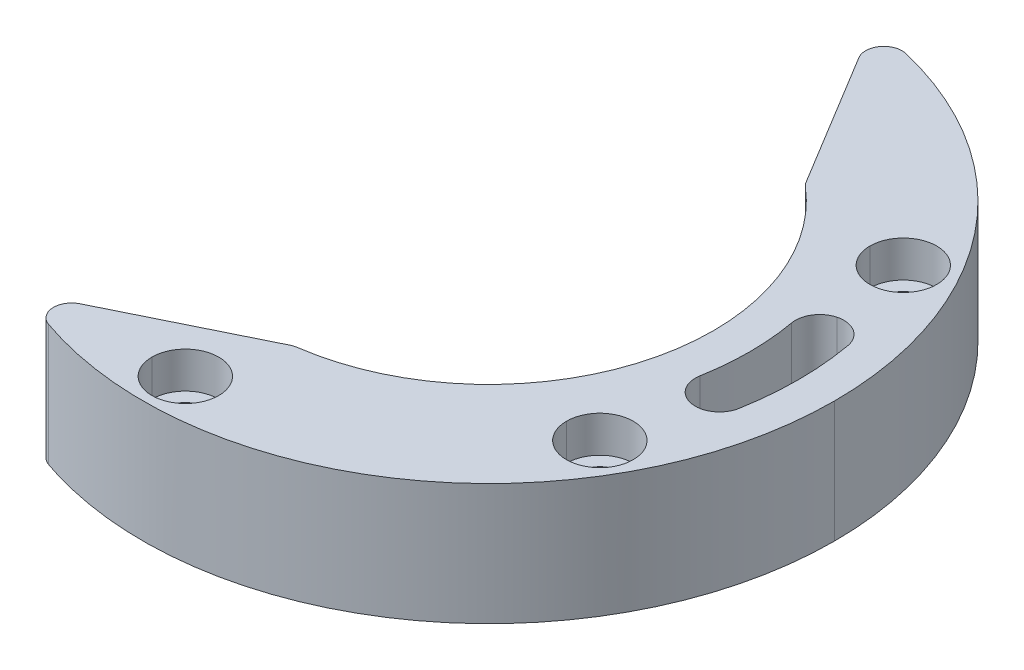
ISO-10303-21;
HEADER;
FILE_DESCRIPTION(('STEP AP214'),'2;1');
FILE_NAME('part.step','',(''),(''),'','','');
FILE_SCHEMA(('AUTOMOTIVE_DESIGN { 1 0 10303 214 1 1 1 1 }'));
ENDSEC;
DATA;
#1=APPLICATION_CONTEXT('core data for automotive mechanical design processes');
#2=APPLICATION_PROTOCOL_DEFINITION('international standard','automotive_design',2000,#1);
#3=PRODUCT_CONTEXT('',#1,'mechanical');
#4=PRODUCT('Part','Part','',(#3));
#5=PRODUCT_RELATED_PRODUCT_CATEGORY('part','',(#4));
#6=PRODUCT_DEFINITION_FORMATION('','',#4);
#7=PRODUCT_DEFINITION_CONTEXT('part definition',#1,'design');
#8=PRODUCT_DEFINITION('design','',#6,#7);
#9=PRODUCT_DEFINITION_SHAPE('','',#8);
#10=(LENGTH_UNIT() NAMED_UNIT(*) SI_UNIT(.MILLI.,.METRE.));
#11=(NAMED_UNIT(*) PLANE_ANGLE_UNIT() SI_UNIT($,.RADIAN.));
#12=(NAMED_UNIT(*) SI_UNIT($,.STERADIAN.) SOLID_ANGLE_UNIT());
#13=UNCERTAINTY_MEASURE_WITH_UNIT(LENGTH_MEASURE(1.E-05),#10,'distance_accuracy_value','');
#14=(GEOMETRIC_REPRESENTATION_CONTEXT(3) GLOBAL_UNCERTAINTY_ASSIGNED_CONTEXT((#13)) GLOBAL_UNIT_ASSIGNED_CONTEXT((#10,
#11,#12)) REPRESENTATION_CONTEXT('',''));
#15=CARTESIAN_POINT('',(0.,0.,0.));
#16=DIRECTION('',(0.,0.,1.));
#17=DIRECTION('',(1.,0.,0.));
#18=AXIS2_PLACEMENT_3D('',#15,#16,#17);
#19=CARTESIAN_POINT('',(0.,5.,25.));
#20=DIRECTION('',(0.,1.,0.));
#21=DIRECTION('',(-1.,0.,0.));
#22=AXIS2_PLACEMENT_3D('',#19,#20,#21);
#23=CYLINDRICAL_SURFACE('',#22,2.75);
#24=DIRECTION('',(0.,1.,0.));
#25=VECTOR('',#24,1.);
#26=CARTESIAN_POINT('',(2.75000000000001,1.99999999999999,25.));
#27=LINE('',#26,#25);
#28=CARTESIAN_POINT('',(2.75000000000001,1.99999999999999,25.));
#29=VERTEX_POINT('',#28);
#30=CARTESIAN_POINT('',(2.75000000000001,5.,25.));
#31=VERTEX_POINT('',#30);
#32=EDGE_CURVE('E11',#29,#31,#27,.T.);
#33=ORIENTED_EDGE('',*,*,#32,.F.);
#34=CARTESIAN_POINT('',(0.,1.99999999999999,25.));
#35=DIRECTION('',(0.,1.,0.));
#36=DIRECTION('',(-1.,0.,0.));
#37=AXIS2_PLACEMENT_3D('',#34,#35,#36);
#38=CIRCLE('',#37,2.75);
#39=CARTESIAN_POINT('',(-2.75,1.99999999999999,25.));
#40=VERTEX_POINT('',#39);
#41=EDGE_CURVE('E347',#40,#29,#38,.T.);
#42=ORIENTED_EDGE('',*,*,#41,.F.);
#43=DIRECTION('',(0.,1.,0.));
#44=VECTOR('',#43,1.);
#45=CARTESIAN_POINT('',(-2.75,1.99999999999999,25.));
#46=LINE('',#45,#44);
#47=CARTESIAN_POINT('',(-2.75,5.,25.));
#48=VERTEX_POINT('',#47);
#49=EDGE_CURVE('E19',#40,#48,#46,.T.);
#50=ORIENTED_EDGE('',*,*,#49,.T.);
#51=CARTESIAN_POINT('',(0.,5.,25.));
#52=DIRECTION('',(0.,-1.,0.));
#53=DIRECTION('',(1.,0.,0.));
#54=AXIS2_PLACEMENT_3D('',#51,#52,#53);
#55=CIRCLE('',#54,2.75);
#56=EDGE_CURVE('E478',#31,#48,#55,.T.);
#57=ORIENTED_EDGE('',*,*,#56,.F.);
#58=EDGE_LOOP('',(#33,#42,#50,#57));
#59=FACE_BOUND('',#58,.T.);
#60=ADVANCED_FACE('F16',(#59),#23,.F.);
#61=CARTESIAN_POINT('',(0.,5.,25.));
#62=DIRECTION('',(0.,1.,0.));
#63=DIRECTION('',(-1.,0.,0.));
#64=AXIS2_PLACEMENT_3D('',#61,#62,#63);
#65=CYLINDRICAL_SURFACE('',#64,2.75);
#66=ORIENTED_EDGE('',*,*,#32,.T.);
#67=CARTESIAN_POINT('',(0.,5.,25.));
#68=DIRECTION('',(0.,-1.,0.));
#69=DIRECTION('',(-1.,0.,0.));
#70=AXIS2_PLACEMENT_3D('',#67,#68,#69);
#71=CIRCLE('',#70,2.75);
#72=EDGE_CURVE('E475',#48,#31,#71,.T.);
#73=ORIENTED_EDGE('',*,*,#72,.F.);
#74=ORIENTED_EDGE('',*,*,#49,.F.);
#75=CARTESIAN_POINT('',(0.,1.99999999999999,25.));
#76=DIRECTION('',(0.,1.,0.));
#77=DIRECTION('',(1.,0.,0.));
#78=AXIS2_PLACEMENT_3D('',#75,#76,#77);
#79=CIRCLE('',#78,2.75);
#80=EDGE_CURVE('E344',#29,#40,#79,.T.);
#81=ORIENTED_EDGE('',*,*,#80,.F.);
#82=EDGE_LOOP('',(#66,#73,#74,#81));
#83=FACE_BOUND('',#82,.T.);
#84=ADVANCED_FACE('F508',(#83),#65,.F.);
#85=CARTESIAN_POINT('',(0.,2.,0.));
#86=DIRECTION('',(0.,1.,0.));
#87=DIRECTION('',(-1.,0.,0.));
#88=AXIS2_PLACEMENT_3D('',#85,#86,#87);
#89=PLANE('',#88);
#90=CARTESIAN_POINT('',(0.,1.99999999999999,25.));
#91=DIRECTION('',(0.,-1.,0.));
#92=DIRECTION('',(1.,0.,0.));
#93=AXIS2_PLACEMENT_3D('',#90,#91,#92);
#94=CIRCLE('',#93,1.6);
#95=CARTESIAN_POINT('',(1.59999999999999,1.99999999999999,25.));
#96=VERTEX_POINT('',#95);
#97=CARTESIAN_POINT('',(-1.60000000000002,1.99999999999999,25.));
#98=VERTEX_POINT('',#97);
#99=EDGE_CURVE('E343',#96,#98,#94,.T.);
#100=ORIENTED_EDGE('',*,*,#99,.T.);
#101=CARTESIAN_POINT('',(0.,1.99999999999999,25.));
#102=DIRECTION('',(0.,-1.,0.));
#103=DIRECTION('',(-1.,0.,0.));
#104=AXIS2_PLACEMENT_3D('',#101,#102,#103);
#105=CIRCLE('',#104,1.6);
#106=EDGE_CURVE('E340',#98,#96,#105,.T.);
#107=ORIENTED_EDGE('',*,*,#106,.T.);
#108=EDGE_LOOP('',(#100,#107));
#109=FACE_BOUND('',#108,.T.);
#110=ORIENTED_EDGE('',*,*,#41,.T.);
#111=ORIENTED_EDGE('',*,*,#80,.T.);
#112=EDGE_LOOP('',(#110,#111));
#113=FACE_BOUND('',#112,.T.);
#114=ADVANCED_FACE('F354',(#109,#113),#89,.T.);
#115=CARTESIAN_POINT('',(0.,-5.,25.));
#116=DIRECTION('',(0.,-1.,0.));
#117=DIRECTION('',(1.,0.,0.));
#118=AXIS2_PLACEMENT_3D('',#115,#116,#117);
#119=CYLINDRICAL_SURFACE('',#118,1.6);
#120=CARTESIAN_POINT('',(0.,-5.,25.));
#121=DIRECTION('',(0.,1.,0.));
#122=DIRECTION('',(-1.,0.,0.));
#123=AXIS2_PLACEMENT_3D('',#120,#121,#122);
#124=CIRCLE('',#123,1.6);
#125=CARTESIAN_POINT('',(-1.6,-5.,25.));
#126=VERTEX_POINT('',#125);
#127=CARTESIAN_POINT('',(1.6,-5.,25.));
#128=VERTEX_POINT('',#127);
#129=EDGE_CURVE('E261',#126,#128,#124,.T.);
#130=ORIENTED_EDGE('',*,*,#129,.F.);
#131=DIRECTION('',(0.,-1.,0.));
#132=VECTOR('',#131,1.);
#133=CARTESIAN_POINT('',(-1.60000000000002,1.99999999999999,25.));
#134=LINE('',#133,#132);
#135=EDGE_CURVE('E336',#98,#126,#134,.T.);
#136=ORIENTED_EDGE('',*,*,#135,.F.);
#137=ORIENTED_EDGE('',*,*,#99,.F.);
#138=DIRECTION('',(0.,-1.,0.));
#139=VECTOR('',#138,1.);
#140=CARTESIAN_POINT('',(1.59999999999999,1.99999999999999,25.));
#141=LINE('',#140,#139);
#142=EDGE_CURVE('E341',#96,#128,#141,.T.);
#143=ORIENTED_EDGE('',*,*,#142,.T.);
#144=EDGE_LOOP('',(#130,#136,#137,#143));
#145=FACE_BOUND('',#144,.T.);
#146=ADVANCED_FACE('F359',(#145),#119,.F.);
#147=CARTESIAN_POINT('',(0.,-5.,25.));
#148=DIRECTION('',(0.,-1.,0.));
#149=DIRECTION('',(1.,0.,0.));
#150=AXIS2_PLACEMENT_3D('',#147,#148,#149);
#151=CYLINDRICAL_SURFACE('',#150,1.6);
#152=CARTESIAN_POINT('',(0.,-5.,25.));
#153=DIRECTION('',(0.,1.,0.));
#154=DIRECTION('',(1.,0.,0.));
#155=AXIS2_PLACEMENT_3D('',#152,#153,#154);
#156=CIRCLE('',#155,1.6);
#157=EDGE_CURVE('E258',#128,#126,#156,.T.);
#158=ORIENTED_EDGE('',*,*,#157,.F.);
#159=ORIENTED_EDGE('',*,*,#142,.F.);
#160=ORIENTED_EDGE('',*,*,#106,.F.);
#161=ORIENTED_EDGE('',*,*,#135,.T.);
#162=EDGE_LOOP('',(#158,#159,#160,#161));
#163=FACE_BOUND('',#162,.T.);
#164=ADVANCED_FACE('F362',(#163),#151,.F.);
#165=CARTESIAN_POINT('',(21.6506350946111,5.,12.5));
#166=DIRECTION('',(0.,1.,0.));
#167=DIRECTION('',(-1.,0.,0.));
#168=AXIS2_PLACEMENT_3D('',#165,#166,#167);
#169=CYLINDRICAL_SURFACE('',#168,2.75);
#170=DIRECTION('',(0.,1.,0.));
#171=VECTOR('',#170,1.);
#172=CARTESIAN_POINT('',(24.4006350946111,2.,12.5));
#173=LINE('',#172,#171);
#174=CARTESIAN_POINT('',(24.4006350946111,2.,12.5));
#175=VERTEX_POINT('',#174);
#176=CARTESIAN_POINT('',(24.4006350946111,5.,12.5));
#177=VERTEX_POINT('',#176);
#178=EDGE_CURVE('E333',#175,#177,#173,.T.);
#179=ORIENTED_EDGE('',*,*,#178,.F.);
#180=CARTESIAN_POINT('',(21.6506350946111,2.,12.5));
#181=DIRECTION('',(0.,1.,0.));
#182=DIRECTION('',(-1.,0.,0.));
#183=AXIS2_PLACEMENT_3D('',#180,#181,#182);
#184=CIRCLE('',#183,2.75);
#185=CARTESIAN_POINT('',(18.900635094611,2.,12.5));
#186=VERTEX_POINT('',#185);
#187=EDGE_CURVE('E327',#186,#175,#184,.T.);
#188=ORIENTED_EDGE('',*,*,#187,.F.);
#189=DIRECTION('',(0.,1.,0.));
#190=VECTOR('',#189,1.);
#191=CARTESIAN_POINT('',(18.900635094611,2.,12.5));
#192=LINE('',#191,#190);
#193=CARTESIAN_POINT('',(18.900635094611,5.,12.5));
#194=VERTEX_POINT('',#193);
#195=EDGE_CURVE('E330',#186,#194,#192,.T.);
#196=ORIENTED_EDGE('',*,*,#195,.T.);
#197=CARTESIAN_POINT('',(21.6506350946111,5.,12.5));
#198=DIRECTION('',(0.,-1.,0.));
#199=DIRECTION('',(1.,0.,0.));
#200=AXIS2_PLACEMENT_3D('',#197,#198,#199);
#201=CIRCLE('',#200,2.75);
#202=EDGE_CURVE('E396',#177,#194,#201,.T.);
#203=ORIENTED_EDGE('',*,*,#202,.F.);
#204=EDGE_LOOP('',(#179,#188,#196,#203));
#205=FACE_BOUND('',#204,.T.);
#206=ADVANCED_FACE('F487',(#205),#169,.F.);
#207=CARTESIAN_POINT('',(21.6506350946111,5.,12.5));
#208=DIRECTION('',(0.,1.,0.));
#209=DIRECTION('',(-1.,0.,0.));
#210=AXIS2_PLACEMENT_3D('',#207,#208,#209);
#211=CYLINDRICAL_SURFACE('',#210,2.75);
#212=ORIENTED_EDGE('',*,*,#178,.T.);
#213=CARTESIAN_POINT('',(21.6506350946111,5.,12.5));
#214=DIRECTION('',(0.,-1.,0.));
#215=DIRECTION('',(-1.,0.,0.));
#216=AXIS2_PLACEMENT_3D('',#213,#214,#215);
#217=CIRCLE('',#216,2.75);
#218=EDGE_CURVE('E481',#194,#177,#217,.T.);
#219=ORIENTED_EDGE('',*,*,#218,.F.);
#220=ORIENTED_EDGE('',*,*,#195,.F.);
#221=CARTESIAN_POINT('',(21.6506350946111,2.,12.5));
#222=DIRECTION('',(0.,1.,0.));
#223=DIRECTION('',(1.,0.,0.));
#224=AXIS2_PLACEMENT_3D('',#221,#222,#223);
#225=CIRCLE('',#224,2.75);
#226=EDGE_CURVE('E324',#175,#186,#225,.T.);
#227=ORIENTED_EDGE('',*,*,#226,.F.);
#228=EDGE_LOOP('',(#212,#219,#220,#227));
#229=FACE_BOUND('',#228,.T.);
#230=ADVANCED_FACE('F491',(#229),#211,.F.);
#231=CARTESIAN_POINT('',(0.,2.,0.));
#232=DIRECTION('',(0.,1.,0.));
#233=DIRECTION('',(-1.,0.,0.));
#234=AXIS2_PLACEMENT_3D('',#231,#232,#233);
#235=PLANE('',#234);
#236=CARTESIAN_POINT('',(21.6506350946111,2.,12.5));
#237=DIRECTION('',(0.,-1.,0.));
#238=DIRECTION('',(1.,0.,0.));
#239=AXIS2_PLACEMENT_3D('',#236,#237,#238);
#240=CIRCLE('',#239,1.6);
#241=CARTESIAN_POINT('',(23.2506350946111,2.,12.5));
#242=VERTEX_POINT('',#241);
#243=CARTESIAN_POINT('',(20.050635094611,2.,12.5));
#244=VERTEX_POINT('',#243);
#245=EDGE_CURVE('E323',#242,#244,#240,.T.);
#246=ORIENTED_EDGE('',*,*,#245,.T.);
#247=CARTESIAN_POINT('',(21.6506350946111,2.,12.5));
#248=DIRECTION('',(0.,-1.,0.));
#249=DIRECTION('',(-1.,0.,0.));
#250=AXIS2_PLACEMENT_3D('',#247,#248,#249);
#251=CIRCLE('',#250,1.6);
#252=EDGE_CURVE('E320',#244,#242,#251,.T.);
#253=ORIENTED_EDGE('',*,*,#252,.T.);
#254=EDGE_LOOP('',(#246,#253));
#255=FACE_BOUND('',#254,.T.);
#256=ORIENTED_EDGE('',*,*,#187,.T.);
#257=ORIENTED_EDGE('',*,*,#226,.T.);
#258=EDGE_LOOP('',(#256,#257));
#259=FACE_BOUND('',#258,.T.);
#260=ADVANCED_FACE('F493',(#255,#259),#235,.T.);
#261=CARTESIAN_POINT('',(21.6506350946111,-5.,12.5));
#262=DIRECTION('',(0.,-1.,0.));
#263=DIRECTION('',(1.,0.,0.));
#264=AXIS2_PLACEMENT_3D('',#261,#262,#263);
#265=CYLINDRICAL_SURFACE('',#264,1.6);
#266=CARTESIAN_POINT('',(21.6506350946111,-5.,12.5));
#267=DIRECTION('',(0.,1.,0.));
#268=DIRECTION('',(-1.,0.,0.));
#269=AXIS2_PLACEMENT_3D('',#266,#267,#268);
#270=CIRCLE('',#269,1.6);
#271=CARTESIAN_POINT('',(20.050635094611,-5.,12.5));
#272=VERTEX_POINT('',#271);
#273=CARTESIAN_POINT('',(23.2506350946111,-5.,12.5));
#274=VERTEX_POINT('',#273);
#275=EDGE_CURVE('E255',#272,#274,#270,.T.);
#276=ORIENTED_EDGE('',*,*,#275,.F.);
#277=DIRECTION('',(0.,-1.,0.));
#278=VECTOR('',#277,1.);
#279=CARTESIAN_POINT('',(20.050635094611,2.,12.5));
#280=LINE('',#279,#278);
#281=EDGE_CURVE('E316',#244,#272,#280,.T.);
#282=ORIENTED_EDGE('',*,*,#281,.F.);
#283=ORIENTED_EDGE('',*,*,#245,.F.);
#284=DIRECTION('',(0.,-1.,0.));
#285=VECTOR('',#284,1.);
#286=CARTESIAN_POINT('',(23.2506350946111,2.,12.5));
#287=LINE('',#286,#285);
#288=EDGE_CURVE('E321',#242,#274,#287,.T.);
#289=ORIENTED_EDGE('',*,*,#288,.T.);
#290=EDGE_LOOP('',(#276,#282,#283,#289));
#291=FACE_BOUND('',#290,.T.);
#292=ADVANCED_FACE('F495',(#291),#265,.F.);
#293=CARTESIAN_POINT('',(21.6506350946111,-5.,12.5));
#294=DIRECTION('',(0.,-1.,0.));
#295=DIRECTION('',(1.,0.,0.));
#296=AXIS2_PLACEMENT_3D('',#293,#294,#295);
#297=CYLINDRICAL_SURFACE('',#296,1.6);
#298=CARTESIAN_POINT('',(21.6506350946111,-5.,12.5));
#299=DIRECTION('',(0.,1.,0.));
#300=DIRECTION('',(1.,0.,0.));
#301=AXIS2_PLACEMENT_3D('',#298,#299,#300);
#302=CIRCLE('',#301,1.6);
#303=EDGE_CURVE('E252',#274,#272,#302,.T.);
#304=ORIENTED_EDGE('',*,*,#303,.F.);
#305=ORIENTED_EDGE('',*,*,#288,.F.);
#306=ORIENTED_EDGE('',*,*,#252,.F.);
#307=ORIENTED_EDGE('',*,*,#281,.T.);
#308=EDGE_LOOP('',(#304,#305,#306,#307));
#309=FACE_BOUND('',#308,.T.);
#310=ADVANCED_FACE('F503',(#309),#297,.F.);
#311=CARTESIAN_POINT('',(21.6506350946111,4.99999999999999,-12.5000000000001));
#312=DIRECTION('',(0.,1.,0.));
#313=DIRECTION('',(-1.,0.,0.));
#314=AXIS2_PLACEMENT_3D('',#311,#312,#313);
#315=CYLINDRICAL_SURFACE('',#314,2.75);
#316=DIRECTION('',(0.,1.,0.));
#317=VECTOR('',#316,1.);
#318=CARTESIAN_POINT('',(24.4006350946111,1.9999999999999,-12.5000000000001));
#319=LINE('',#318,#317);
#320=CARTESIAN_POINT('',(24.4006350946111,1.9999999999999,-12.5000000000001));
#321=VERTEX_POINT('',#320);
#322=CARTESIAN_POINT('',(24.4006350946111,4.99999999999999,-12.5000000000001));
#323=VERTEX_POINT('',#322);
#324=EDGE_CURVE('E313',#321,#323,#319,.T.);
#325=ORIENTED_EDGE('',*,*,#324,.F.);
#326=CARTESIAN_POINT('',(21.6506350946111,1.9999999999999,-12.5000000000001));
#327=DIRECTION('',(0.,1.,0.));
#328=DIRECTION('',(-1.,0.,0.));
#329=AXIS2_PLACEMENT_3D('',#326,#327,#328);
#330=CIRCLE('',#329,2.75);
#331=CARTESIAN_POINT('',(18.900635094611,1.9999999999999,-12.5));
#332=VERTEX_POINT('',#331);
#333=EDGE_CURVE('E307',#332,#321,#330,.T.);
#334=ORIENTED_EDGE('',*,*,#333,.F.);
#335=DIRECTION('',(0.,1.,0.));
#336=VECTOR('',#335,1.);
#337=CARTESIAN_POINT('',(18.900635094611,1.9999999999999,-12.5));
#338=LINE('',#337,#336);
#339=CARTESIAN_POINT('',(18.900635094611,4.99999999999991,-12.5));
#340=VERTEX_POINT('',#339);
#341=EDGE_CURVE('E310',#332,#340,#338,.T.);
#342=ORIENTED_EDGE('',*,*,#341,.T.);
#343=CARTESIAN_POINT('',(21.6506350946111,4.99999999999999,-12.5000000000001));
#344=DIRECTION('',(0.,-1.,0.));
#345=DIRECTION('',(1.,0.,0.));
#346=AXIS2_PLACEMENT_3D('',#343,#344,#345);
#347=CIRCLE('',#346,2.75);
#348=EDGE_CURVE('E395',#323,#340,#347,.T.);
#349=ORIENTED_EDGE('',*,*,#348,.F.);
#350=EDGE_LOOP('',(#325,#334,#342,#349));
#351=FACE_BOUND('',#350,.T.);
#352=ADVANCED_FACE('F388',(#351),#315,.F.);
#353=CARTESIAN_POINT('',(21.6506350946111,4.99999999999999,-12.5000000000001));
#354=DIRECTION('',(0.,1.,0.));
#355=DIRECTION('',(-1.,0.,0.));
#356=AXIS2_PLACEMENT_3D('',#353,#354,#355);
#357=CYLINDRICAL_SURFACE('',#356,2.75);
#358=ORIENTED_EDGE('',*,*,#324,.T.);
#359=CARTESIAN_POINT('',(21.6506350946111,4.99999999999999,-12.5000000000001));
#360=DIRECTION('',(0.,-1.,0.));
#361=DIRECTION('',(-1.,0.,0.));
#362=AXIS2_PLACEMENT_3D('',#359,#360,#361);
#363=CIRCLE('',#362,2.75);
#364=EDGE_CURVE('E392',#340,#323,#363,.T.);
#365=ORIENTED_EDGE('',*,*,#364,.F.);
#366=ORIENTED_EDGE('',*,*,#341,.F.);
#367=CARTESIAN_POINT('',(21.6506350946111,1.9999999999999,-12.5000000000001));
#368=DIRECTION('',(0.,1.,0.));
#369=DIRECTION('',(1.,0.,0.));
#370=AXIS2_PLACEMENT_3D('',#367,#368,#369);
#371=CIRCLE('',#370,2.75);
#372=EDGE_CURVE('E304',#321,#332,#371,.T.);
#373=ORIENTED_EDGE('',*,*,#372,.F.);
#374=EDGE_LOOP('',(#358,#365,#366,#373));
#375=FACE_BOUND('',#374,.T.);
#376=ADVANCED_FACE('F383',(#375),#357,.F.);
#377=CARTESIAN_POINT('',(0.,2.,0.));
#378=DIRECTION('',(0.,1.,0.));
#379=DIRECTION('',(-1.,0.,0.));
#380=AXIS2_PLACEMENT_3D('',#377,#378,#379);
#381=PLANE('',#380);
#382=CARTESIAN_POINT('',(21.6506350946111,1.9999999999999,-12.5000000000001));
#383=DIRECTION('',(0.,-1.,0.));
#384=DIRECTION('',(1.,0.,0.));
#385=AXIS2_PLACEMENT_3D('',#382,#383,#384);
#386=CIRCLE('',#385,1.6);
#387=CARTESIAN_POINT('',(23.2506350946111,1.9999999999999,-12.5000000000001));
#388=VERTEX_POINT('',#387);
#389=CARTESIAN_POINT('',(20.0506350946111,1.9999999999999,-12.5000000000001));
#390=VERTEX_POINT('',#389);
#391=EDGE_CURVE('E303',#388,#390,#386,.T.);
#392=ORIENTED_EDGE('',*,*,#391,.T.);
#393=CARTESIAN_POINT('',(21.6506350946111,1.9999999999999,-12.5000000000001));
#394=DIRECTION('',(0.,-1.,0.));
#395=DIRECTION('',(-1.,0.,0.));
#396=AXIS2_PLACEMENT_3D('',#393,#394,#395);
#397=CIRCLE('',#396,1.6);
#398=EDGE_CURVE('E300',#390,#388,#397,.T.);
#399=ORIENTED_EDGE('',*,*,#398,.T.);
#400=EDGE_LOOP('',(#392,#399));
#401=FACE_BOUND('',#400,.T.);
#402=ORIENTED_EDGE('',*,*,#333,.T.);
#403=ORIENTED_EDGE('',*,*,#372,.T.);
#404=EDGE_LOOP('',(#402,#403));
#405=FACE_BOUND('',#404,.T.);
#406=ADVANCED_FACE('F380',(#401,#405),#381,.T.);
#407=CARTESIAN_POINT('',(21.6506350946111,-5.,-12.5000000000001));
#408=DIRECTION('',(0.,-1.,0.));
#409=DIRECTION('',(1.,0.,0.));
#410=AXIS2_PLACEMENT_3D('',#407,#408,#409);
#411=CYLINDRICAL_SURFACE('',#410,1.6);
#412=CARTESIAN_POINT('',(21.6506350946111,-5.,-12.5000000000001));
#413=DIRECTION('',(0.,1.,0.));
#414=DIRECTION('',(-1.,0.,0.));
#415=AXIS2_PLACEMENT_3D('',#412,#413,#414);
#416=CIRCLE('',#415,1.6);
#417=CARTESIAN_POINT('',(20.0506350946111,-5.0000000000001,-12.5000000000001));
#418=VERTEX_POINT('',#417);
#419=CARTESIAN_POINT('',(23.2506350946111,-5.,-12.5000000000001));
#420=VERTEX_POINT('',#419);
#421=EDGE_CURVE('E249',#418,#420,#416,.T.);
#422=ORIENTED_EDGE('',*,*,#421,.F.);
#423=DIRECTION('',(0.,-1.,0.));
#424=VECTOR('',#423,1.);
#425=CARTESIAN_POINT('',(20.0506350946111,1.9999999999999,-12.5000000000001));
#426=LINE('',#425,#424);
#427=EDGE_CURVE('E293',#390,#418,#426,.T.);
#428=ORIENTED_EDGE('',*,*,#427,.F.);
#429=ORIENTED_EDGE('',*,*,#391,.F.);
#430=DIRECTION('',(0.,-1.,0.));
#431=VECTOR('',#430,1.);
#432=CARTESIAN_POINT('',(23.2506350946111,1.9999999999999,-12.5000000000001));
#433=LINE('',#432,#431);
#434=EDGE_CURVE('E301',#388,#420,#433,.T.);
#435=ORIENTED_EDGE('',*,*,#434,.T.);
#436=EDGE_LOOP('',(#422,#428,#429,#435));
#437=FACE_BOUND('',#436,.T.);
#438=ADVANCED_FACE('F373',(#437),#411,.F.);
#439=CARTESIAN_POINT('',(21.6506350946111,-5.,-12.5000000000001));
#440=DIRECTION('',(0.,-1.,0.));
#441=DIRECTION('',(1.,0.,0.));
#442=AXIS2_PLACEMENT_3D('',#439,#440,#441);
#443=CYLINDRICAL_SURFACE('',#442,1.6);
#444=CARTESIAN_POINT('',(21.6506350946111,-5.,-12.5000000000001));
#445=DIRECTION('',(0.,1.,0.));
#446=DIRECTION('',(1.,0.,0.));
#447=AXIS2_PLACEMENT_3D('',#444,#445,#446);
#448=CIRCLE('',#447,1.6);
#449=EDGE_CURVE('E246',#420,#418,#448,.T.);
#450=ORIENTED_EDGE('',*,*,#449,.F.);
#451=ORIENTED_EDGE('',*,*,#434,.F.);
#452=ORIENTED_EDGE('',*,*,#398,.F.);
#453=ORIENTED_EDGE('',*,*,#427,.T.);
#454=EDGE_LOOP('',(#450,#451,#452,#453));
#455=FACE_BOUND('',#454,.T.);
#456=ADVANCED_FACE('F378',(#455),#443,.F.);
#457=CARTESIAN_POINT('',(0.,5.,0.));
#458=DIRECTION('',(0.,1.,0.));
#459=DIRECTION('',(-1.,0.,0.));
#460=AXIS2_PLACEMENT_3D('',#457,#458,#459);
#461=CYLINDRICAL_SURFACE('',#460,21.5);
#462=CARTESIAN_POINT('',(0.,-5.,0.));
#463=DIRECTION('',(0.,-1.,0.));
#464=DIRECTION('',(0.984448474716304,0.,-0.175673562691573));
#465=AXIS2_PLACEMENT_3D('',#462,#463,#464);
#466=CIRCLE('',#465,21.5);
#467=CARTESIAN_POINT('',(21.1656422064005,-5.0000000000001,-3.77698159786852));
#468=VERTEX_POINT('',#467);
#469=CARTESIAN_POINT('',(21.5,-5.0000000000001,0.));
#470=VERTEX_POINT('',#469);
#471=EDGE_CURVE('E244',#468,#470,#466,.T.);
#472=ORIENTED_EDGE('',*,*,#471,.F.);
#473=DIRECTION('',(0.,1.,0.));
#474=VECTOR('',#473,1.);
#475=CARTESIAN_POINT('',(21.1656422064005,-5.0000000000001,-3.77698159786839));
#476=LINE('',#475,#474);
#477=CARTESIAN_POINT('',(21.1656422064006,4.9999999999999,-3.77698159786856));
#478=VERTEX_POINT('',#477);
#479=EDGE_CURVE('E294',#468,#478,#476,.T.);
#480=ORIENTED_EDGE('',*,*,#479,.T.);
#481=CARTESIAN_POINT('',(0.,5.,0.));
#482=DIRECTION('',(0.,1.,0.));
#483=DIRECTION('',(1.,0.,0.));
#484=AXIS2_PLACEMENT_3D('',#481,#482,#483);
#485=CIRCLE('',#484,21.5);
#486=CARTESIAN_POINT('',(21.5000000000001,4.99999999999991,0.));
#487=VERTEX_POINT('',#486);
#488=EDGE_CURVE('E30',#487,#478,#485,.T.);
#489=ORIENTED_EDGE('',*,*,#488,.F.);
#490=CARTESIAN_POINT('',(0.,5.,0.));
#491=DIRECTION('',(0.,1.,0.));
#492=DIRECTION('',(0.984448474716305,0.,0.175673562691574));
#493=AXIS2_PLACEMENT_3D('',#490,#491,#492);
#494=CIRCLE('',#493,21.5);
#495=CARTESIAN_POINT('',(21.1656422064006,5.,3.77698159786854));
#496=VERTEX_POINT('',#495);
#497=EDGE_CURVE('E456',#496,#487,#494,.T.);
#498=ORIENTED_EDGE('',*,*,#497,.F.);
#499=DIRECTION('',(0.,1.,0.));
#500=VECTOR('',#499,1.);
#501=CARTESIAN_POINT('',(21.1656422064005,-4.99999999999999,3.77698159786839));
#502=LINE('',#501,#500);
#503=CARTESIAN_POINT('',(21.1656422064005,-5.,3.77698159786855));
#504=VERTEX_POINT('',#503);
#505=EDGE_CURVE('E290',#504,#496,#502,.T.);
#506=ORIENTED_EDGE('',*,*,#505,.F.);
#507=CARTESIAN_POINT('',(0.,-5.,0.));
#508=DIRECTION('',(0.,-1.,0.));
#509=DIRECTION('',(1.,0.,0.));
#510=AXIS2_PLACEMENT_3D('',#507,#508,#509);
#511=CIRCLE('',#510,21.5);
#512=EDGE_CURVE('E239',#470,#504,#511,.T.);
#513=ORIENTED_EDGE('',*,*,#512,.F.);
#514=EDGE_LOOP('',(#472,#480,#489,#498,#506,#513));
#515=FACE_BOUND('',#514,.T.);
#516=ADVANCED_FACE('F455',(#515),#461,.T.);
#517=CARTESIAN_POINT('',(23.1345391558331,18.036,4.1283287232515));
#518=DIRECTION('',(0.,-1.,0.));
#519=DIRECTION('',(-0.25881904510252,0.,0.965925826289073));
#520=AXIS2_PLACEMENT_3D('',#517,#518,#519);
#521=CYLINDRICAL_SURFACE('',#520,2.);
#522=DIRECTION('',(0.,1.,0.));
#523=VECTOR('',#522,1.);
#524=CARTESIAN_POINT('',(22.6169010656282,-4.99999999999999,6.06018037582971));
#525=LINE('',#524,#523);
#526=CARTESIAN_POINT('',(22.6169010656282,-5.,6.06018037582971));
#527=VERTEX_POINT('',#526);
#528=CARTESIAN_POINT('',(22.6169010656282,5.,6.06018037582964));
#529=VERTEX_POINT('',#528);
#530=EDGE_CURVE('E225',#527,#529,#525,.T.);
#531=ORIENTED_EDGE('',*,*,#530,.F.);
#532=CARTESIAN_POINT('',(23.1345391558331,-4.99999999999999,4.12832872325152));
#533=DIRECTION('',(0.,1.,0.));
#534=DIRECTION('',(-0.984448474716346,0.,-0.175673562691338));
#535=AXIS2_PLACEMENT_3D('',#532,#533,#534);
#536=CIRCLE('',#535,2.);
#537=EDGE_CURVE('E237',#504,#527,#536,.T.);
#538=ORIENTED_EDGE('',*,*,#537,.F.);
#539=ORIENTED_EDGE('',*,*,#505,.T.);
#540=CARTESIAN_POINT('',(23.1345391558331,5.00000000000001,4.1283287232515));
#541=DIRECTION('',(0.,-1.,0.));
#542=DIRECTION('',(-0.25881904510252,0.,0.965925826289073));
#543=AXIS2_PLACEMENT_3D('',#540,#541,#542);
#544=CIRCLE('',#543,2.);
#545=EDGE_CURVE('E460',#529,#496,#544,.T.);
#546=ORIENTED_EDGE('',*,*,#545,.F.);
#547=EDGE_LOOP('',(#531,#538,#539,#546));
#548=FACE_BOUND('',#547,.T.);
#549=ADVANCED_FACE('F459',(#548),#521,.F.);
#550=CARTESIAN_POINT('',(23.1345391558331,18.036,4.1283287232515));
#551=DIRECTION('',(0.,-1.,0.));
#552=DIRECTION('',(-0.25881904510252,0.,0.965925826289073));
#553=AXIS2_PLACEMENT_3D('',#550,#551,#552);
#554=CYLINDRICAL_SURFACE('',#553,2.);
#555=CARTESIAN_POINT('',(23.1345391558331,5.,4.1283287232515));
#556=DIRECTION('',(0.,-1.,0.));
#557=DIRECTION('',(0.984448474716332,0.,0.175673562691419));
#558=AXIS2_PLACEMENT_3D('',#555,#556,#557);
#559=CIRCLE('',#558,2.);
#560=CARTESIAN_POINT('',(25.1034361052658,5.,4.47967584863451));
#561=VERTEX_POINT('',#560);
#562=EDGE_CURVE('E223',#561,#529,#559,.T.);
#563=ORIENTED_EDGE('',*,*,#562,.F.);
#564=DIRECTION('',(0.,1.,0.));
#565=VECTOR('',#564,1.);
#566=CARTESIAN_POINT('',(25.1034361052657,-5.,4.47967584863462));
#567=LINE('',#566,#565);
#568=CARTESIAN_POINT('',(25.1034361052658,-5.,4.47967584863458));
#569=VERTEX_POINT('',#568);
#570=EDGE_CURVE('E216',#569,#561,#567,.T.);
#571=ORIENTED_EDGE('',*,*,#570,.F.);
#572=CARTESIAN_POINT('',(23.1345391558331,-4.99999999999999,4.12832872325152));
#573=DIRECTION('',(0.,1.,0.));
#574=DIRECTION('',(-0.25881904510252,0.,0.965925826289073));
#575=AXIS2_PLACEMENT_3D('',#572,#573,#574);
#576=CIRCLE('',#575,2.);
#577=EDGE_CURVE('E220',#527,#569,#576,.T.);
#578=ORIENTED_EDGE('',*,*,#577,.F.);
#579=ORIENTED_EDGE('',*,*,#530,.T.);
#580=EDGE_LOOP('',(#563,#571,#578,#579));
#581=FACE_BOUND('',#580,.T.);
#582=ADVANCED_FACE('F217',(#581),#554,.F.);
#583=CARTESIAN_POINT('',(0.,5.,0.));
#584=DIRECTION('',(0.,1.,0.));
#585=DIRECTION('',(-1.,0.,0.));
#586=AXIS2_PLACEMENT_3D('',#583,#584,#585);
#587=CYLINDRICAL_SURFACE('',#586,25.5);
#588=CARTESIAN_POINT('',(0.,5.,0.));
#589=DIRECTION('',(0.,-1.,0.));
#590=DIRECTION('',(0.984448474716309,0.,-0.175673562691544));
#591=AXIS2_PLACEMENT_3D('',#588,#589,#590);
#592=CIRCLE('',#591,25.5);
#593=CARTESIAN_POINT('',(25.1034361052658,4.99999999999991,-4.47967584863456));
#594=VERTEX_POINT('',#593);
#595=CARTESIAN_POINT('',(25.5000000000001,4.99999999999991,0.));
#596=VERTEX_POINT('',#595);
#597=EDGE_CURVE('E466',#594,#596,#592,.T.);
#598=ORIENTED_EDGE('',*,*,#597,.F.);
#599=DIRECTION('',(0.,1.,0.));
#600=VECTOR('',#599,1.);
#601=CARTESIAN_POINT('',(25.1034361052657,-5.0000000000001,-4.4796758486346));
#602=LINE('',#601,#600);
#603=CARTESIAN_POINT('',(25.1034361052658,-5.0000000000001,-4.47967584863452));
#604=VERTEX_POINT('',#603);
#605=EDGE_CURVE('E439',#604,#594,#602,.T.);
#606=ORIENTED_EDGE('',*,*,#605,.F.);
#607=CARTESIAN_POINT('',(0.,-5.,0.));
#608=DIRECTION('',(0.,1.,0.));
#609=DIRECTION('',(1.,0.,0.));
#610=AXIS2_PLACEMENT_3D('',#607,#608,#609);
#611=CIRCLE('',#610,25.5);
#612=CARTESIAN_POINT('',(25.5,-5.0000000000001,0.));
#613=VERTEX_POINT('',#612);
#614=EDGE_CURVE('E38',#613,#604,#611,.T.);
#615=ORIENTED_EDGE('',*,*,#614,.F.);
#616=CARTESIAN_POINT('',(0.,-5.,0.));
#617=DIRECTION('',(0.,1.,0.));
#618=DIRECTION('',(0.984448474716309,0.,0.175673562691545));
#619=AXIS2_PLACEMENT_3D('',#616,#617,#618);
#620=CIRCLE('',#619,25.5);
#621=EDGE_CURVE('E228',#569,#613,#620,.T.);
#622=ORIENTED_EDGE('',*,*,#621,.F.);
#623=ORIENTED_EDGE('',*,*,#570,.T.);
#624=CARTESIAN_POINT('',(0.,5.,0.));
#625=DIRECTION('',(0.,-1.,0.));
#626=DIRECTION('',(1.,0.,0.));
#627=AXIS2_PLACEMENT_3D('',#624,#625,#626);
#628=CIRCLE('',#627,25.5);
#629=EDGE_CURVE('E464',#596,#561,#628,.T.);
#630=ORIENTED_EDGE('',*,*,#629,.F.);
#631=EDGE_LOOP('',(#598,#606,#615,#622,#623,#630));
#632=FACE_BOUND('',#631,.T.);
#633=ADVANCED_FACE('F229',(#632),#587,.F.);
#634=CARTESIAN_POINT('',(13.0049136019881,-18.0360000000001,-15.1944799912609));
#635=DIRECTION('',(0.,1.,0.));
#636=DIRECTION('',(-0.85495713892476,0.,0.518698651050488));
#637=AXIS2_PLACEMENT_3D('',#634,#635,#636);
#638=CYLINDRICAL_SURFACE('',#637,1.5);
#639=CARTESIAN_POINT('',(13.0049136019881,-5.0000000000001,-15.1944799912609));
#640=DIRECTION('',(0.,-1.,0.));
#641=DIRECTION('',(-0.650245680099217,0.,0.759723999563207));
#642=AXIS2_PLACEMENT_3D('',#639,#640,#641);
#643=CIRCLE('',#642,1.5);
#644=CARTESIAN_POINT('',(12.0295450818391,-5.0000000000001,-14.0548939919162));
#645=VERTEX_POINT('',#644);
#646=CARTESIAN_POINT('',(11.722477893601,-5.0000000000001,-14.4164320146851));
#647=VERTEX_POINT('',#646);
#648=EDGE_CURVE('E409',#645,#647,#643,.T.);
#649=ORIENTED_EDGE('',*,*,#648,.F.);
#650=DIRECTION('',(0.,-1.,0.));
#651=VECTOR('',#650,1.);
#652=CARTESIAN_POINT('',(12.029545081839,4.99999999999991,-14.0548939919163));
#653=LINE('',#652,#651);
#654=CARTESIAN_POINT('',(12.0295450818391,4.99999999999991,-14.0548939919163));
#655=VERTEX_POINT('',#654);
#656=EDGE_CURVE('E226',#655,#645,#653,.T.);
#657=ORIENTED_EDGE('',*,*,#656,.F.);
#658=CARTESIAN_POINT('',(13.0049136019881,4.99999999999989,-15.1944799912608));
#659=DIRECTION('',(0.,1.,0.));
#660=DIRECTION('',(-0.854957138924806,0.,0.518698651050413));
#661=AXIS2_PLACEMENT_3D('',#658,#659,#660);
#662=CIRCLE('',#661,1.5);
#663=CARTESIAN_POINT('',(11.722477893601,4.99999999999991,-14.4164320146852));
#664=VERTEX_POINT('',#663);
#665=EDGE_CURVE('E714',#664,#655,#662,.T.);
#666=ORIENTED_EDGE('',*,*,#665,.F.);
#667=DIRECTION('',(0.,-1.,0.));
#668=VECTOR('',#667,1.);
#669=CARTESIAN_POINT('',(11.722477893601,4.99999999999989,-14.4164320146852));
#670=LINE('',#669,#668);
#671=EDGE_CURVE('E269',#664,#647,#670,.T.);
#672=ORIENTED_EDGE('',*,*,#671,.T.);
#673=EDGE_LOOP('',(#649,#657,#666,#672));
#674=FACE_BOUND('',#673,.T.);
#675=ADVANCED_FACE('F605',(#674),#638,.T.);
#676=CARTESIAN_POINT('',(0.,5.,0.));
#677=DIRECTION('',(0.,-1.,0.));
#678=DIRECTION('',(1.,0.,0.));
#679=AXIS2_PLACEMENT_3D('',#676,#677,#678);
#680=CYLINDRICAL_SURFACE('',#679,18.5);
#681=CARTESIAN_POINT('',(0.,5.,0.));
#682=DIRECTION('',(0.,-1.,0.));
#683=DIRECTION('',(0.650245680099418,0.,-0.759723999563035));
#684=AXIS2_PLACEMENT_3D('',#681,#682,#683);
#685=CIRCLE('',#684,18.5);
#686=CARTESIAN_POINT('',(18.5000000000001,4.9999999999999,0.));
#687=VERTEX_POINT('',#686);
#688=EDGE_CURVE('E738',#655,#687,#685,.T.);
#689=ORIENTED_EDGE('',*,*,#688,.F.);
#690=ORIENTED_EDGE('',*,*,#656,.T.);
#691=CARTESIAN_POINT('',(0.,-5.,0.));
#692=DIRECTION('',(0.,1.,0.));
#693=DIRECTION('',(1.,0.,0.));
#694=AXIS2_PLACEMENT_3D('',#691,#692,#693);
#695=CIRCLE('',#694,18.5);
#696=CARTESIAN_POINT('',(18.5,-5.0000000000001,0.));
#697=VERTEX_POINT('',#696);
#698=EDGE_CURVE('E413',#697,#645,#695,.T.);
#699=ORIENTED_EDGE('',*,*,#698,.F.);
#700=DIRECTION('',(0.,1.,0.));
#701=VECTOR('',#700,1.);
#702=CARTESIAN_POINT('',(18.5,-5.0000000000001,0.));
#703=LINE('',#702,#701);
#704=EDGE_CURVE('E282',#697,#687,#703,.T.);
#705=ORIENTED_EDGE('',*,*,#704,.T.);
#706=EDGE_LOOP('',(#689,#690,#699,#705));
#707=FACE_BOUND('',#706,.T.);
#708=ADVANCED_FACE('F612',(#707),#680,.F.);
#709=CARTESIAN_POINT('',(0.,5.,0.));
#710=DIRECTION('',(0.,-1.,0.));
#711=DIRECTION('',(1.,0.,0.));
#712=AXIS2_PLACEMENT_3D('',#709,#710,#711);
#713=CYLINDRICAL_SURFACE('',#712,18.5);
#714=ORIENTED_EDGE('',*,*,#704,.F.);
#715=CARTESIAN_POINT('',(0.,-5.,0.));
#716=DIRECTION('',(0.,1.,0.));
#717=DIRECTION('',(0.138138225291018,0.,0.990412959685734));
#718=AXIS2_PLACEMENT_3D('',#715,#716,#717);
#719=CIRCLE('',#718,18.5);
#720=CARTESIAN_POINT('',(2.55555716788385,-5.,18.322639754186));
#721=VERTEX_POINT('',#720);
#722=EDGE_CURVE('E416',#721,#697,#719,.T.);
#723=ORIENTED_EDGE('',*,*,#722,.F.);
#724=DIRECTION('',(0.,-1.,0.));
#725=VECTOR('',#724,1.);
#726=CARTESIAN_POINT('',(2.55555716788383,4.99999999999999,18.322639754186));
#727=LINE('',#726,#725);
#728=CARTESIAN_POINT('',(2.55555716788389,5.,18.322639754186));
#729=VERTEX_POINT('',#728);
#730=EDGE_CURVE('E279',#729,#721,#727,.T.);
#731=ORIENTED_EDGE('',*,*,#730,.F.);
#732=CARTESIAN_POINT('',(0.,5.,0.));
#733=DIRECTION('',(0.,-1.,0.));
#734=DIRECTION('',(1.,0.,0.));
#735=AXIS2_PLACEMENT_3D('',#732,#733,#734);
#736=CIRCLE('',#735,18.5);
#737=EDGE_CURVE('E735',#687,#729,#736,.T.);
#738=ORIENTED_EDGE('',*,*,#737,.F.);
#739=EDGE_LOOP('',(#714,#723,#731,#738));
#740=FACE_BOUND('',#739,.T.);
#741=ADVANCED_FACE('F620',(#740),#713,.F.);
#742=CARTESIAN_POINT('',(2.76276450582045,-18.036,19.8082591937147));
#743=DIRECTION('',(0.,1.,0.));
#744=DIRECTION('',(-0.138138225291024,0.,-0.990412959685734));
#745=AXIS2_PLACEMENT_3D('',#742,#743,#744);
#746=CYLINDRICAL_SURFACE('',#745,1.5);
#747=CARTESIAN_POINT('',(2.76276450582038,-5.,19.8082591937146));
#748=DIRECTION('',(0.,-1.,0.));
#749=DIRECTION('',(-0.440487661567938,0.,-0.897758664679109));
#750=AXIS2_PLACEMENT_3D('',#747,#748,#749);
#751=CIRCLE('',#750,1.5);
#752=CARTESIAN_POINT('',(2.10203301346867,-5.,18.4616211966958));
#753=VERTEX_POINT('',#752);
#754=EDGE_CURVE('E419',#753,#721,#751,.T.);
#755=ORIENTED_EDGE('',*,*,#754,.F.);
#756=DIRECTION('',(0.,1.,0.));
#757=VECTOR('',#756,1.);
#758=CARTESIAN_POINT('',(2.10203301346878,-5.,18.4616211966958));
#759=LINE('',#758,#757);
#760=CARTESIAN_POINT('',(2.10203301346867,5.,18.4616211966958));
#761=VERTEX_POINT('',#760);
#762=EDGE_CURVE('E278',#753,#761,#759,.T.);
#763=ORIENTED_EDGE('',*,*,#762,.T.);
#764=CARTESIAN_POINT('',(2.76276450582038,4.99999999999999,19.8082591937146));
#765=DIRECTION('',(0.,1.,0.));
#766=DIRECTION('',(-0.138138225290984,0.,-0.990412959685739));
#767=AXIS2_PLACEMENT_3D('',#764,#765,#766);
#768=CIRCLE('',#767,1.5);
#769=EDGE_CURVE('E732',#729,#761,#768,.T.);
#770=ORIENTED_EDGE('',*,*,#769,.F.);
#771=ORIENTED_EDGE('',*,*,#730,.T.);
#772=EDGE_LOOP('',(#755,#763,#770,#771));
#773=FACE_BOUND('',#772,.T.);
#774=ADVANCED_FACE('F628',(#773),#746,.T.);
#775=CARTESIAN_POINT('',(-12.4860477138111,5.,25.6193015612923));
#776=DIRECTION('',(-0.440487661567732,0.,-0.89775866467921));
#777=DIRECTION('',(0.89775866467921,0.,-0.440487661567732));
#778=AXIS2_PLACEMENT_3D('',#775,#776,#777);
#779=PLANE('',#778);
#780=ORIENTED_EDGE('',*,*,#762,.F.);
#781=DIRECTION('',(0.89775866467921,0.,-0.440487661567732));
#782=VECTOR('',#781,1.);
#783=CARTESIAN_POINT('',(-9.51346314014752,-5.00000000000001,24.1607950837934));
#784=LINE('',#783,#782);
#785=CARTESIAN_POINT('',(-9.51346314014748,-5.00000000000001,24.1607950837934));
#786=VERTEX_POINT('',#785);
#787=EDGE_CURVE('E422',#786,#753,#784,.T.);
#788=ORIENTED_EDGE('',*,*,#787,.F.);
#789=DIRECTION('',(0.,-1.,0.));
#790=VECTOR('',#789,1.);
#791=CARTESIAN_POINT('',(-9.51346314014748,5.,24.1607950837934));
#792=LINE('',#791,#790);
#793=CARTESIAN_POINT('',(-9.51346314014748,5.,24.1607950837934));
#794=VERTEX_POINT('',#793);
#795=EDGE_CURVE('E275',#794,#786,#792,.T.);
#796=ORIENTED_EDGE('',*,*,#795,.F.);
#797=DIRECTION('',(-0.89775866467921,0.,0.440487661567732));
#798=VECTOR('',#797,1.);
#799=CARTESIAN_POINT('',(2.10203301346845,5.,18.4616211966959));
#800=LINE('',#799,#798);
#801=EDGE_CURVE('E729',#761,#794,#800,.T.);
#802=ORIENTED_EDGE('',*,*,#801,.F.);
#803=EDGE_LOOP('',(#780,#788,#796,#802));
#804=FACE_BOUND('',#803,.T.);
#805=ADVANCED_FACE('F636',(#804),#779,.T.);
#806=CARTESIAN_POINT('',(-8.85273164779585,-18.036,25.5074330808122));
#807=DIRECTION('',(0.,1.,0.));
#808=DIRECTION('',(-0.440487661567731,0.,-0.89775866467921));
#809=AXIS2_PLACEMENT_3D('',#806,#807,#808);
#810=CYLINDRICAL_SURFACE('',#809,1.5);
#811=CARTESIAN_POINT('',(-8.85273164779585,-5.00000000000001,25.5074330808122));
#812=DIRECTION('',(0.,-1.,0.));
#813=DIRECTION('',(-0.32787894991825,0.,0.94471974373383));
#814=AXIS2_PLACEMENT_3D('',#811,#812,#813);
#815=CIRCLE('',#814,1.5);
#816=CARTESIAN_POINT('',(-9.34455007267332,-5.00000000000001,26.9245126964129));
#817=VERTEX_POINT('',#816);
#818=EDGE_CURVE('E425',#817,#786,#815,.T.);
#819=ORIENTED_EDGE('',*,*,#818,.F.);
#820=DIRECTION('',(0.,-1.,0.));
#821=VECTOR('',#820,1.);
#822=CARTESIAN_POINT('',(-9.34455007267342,5.,26.924512696413));
#823=LINE('',#822,#821);
#824=CARTESIAN_POINT('',(-9.34455007267335,5.,26.9245126964129));
#825=VERTEX_POINT('',#824);
#826=EDGE_CURVE('E272',#825,#817,#823,.T.);
#827=ORIENTED_EDGE('',*,*,#826,.F.);
#828=CARTESIAN_POINT('',(-8.85273164779585,5.,25.5074330808122));
#829=DIRECTION('',(0.,1.,0.));
#830=DIRECTION('',(-0.440487661567781,0.,-0.897758664679186));
#831=AXIS2_PLACEMENT_3D('',#828,#829,#830);
#832=CIRCLE('',#831,1.5);
#833=EDGE_CURVE('E726',#794,#825,#832,.T.);
#834=ORIENTED_EDGE('',*,*,#833,.F.);
#835=ORIENTED_EDGE('',*,*,#795,.T.);
#836=EDGE_LOOP('',(#819,#827,#834,#835));
#837=FACE_BOUND('',#836,.T.);
#838=ADVANCED_FACE('F644',(#837),#810,.T.);
#839=CARTESIAN_POINT('',(0.,5.,0.));
#840=DIRECTION('',(0.,-1.,0.));
#841=DIRECTION('',(1.,0.,0.));
#842=AXIS2_PLACEMENT_3D('',#839,#840,#841);
#843=CYLINDRICAL_SURFACE('',#842,28.5);
#844=CARTESIAN_POINT('',(0.,5.,0.));
#845=DIRECTION('',(0.,1.,0.));
#846=DIRECTION('',(-0.327878949918362,0.,0.944719743733792));
#847=AXIS2_PLACEMENT_3D('',#844,#845,#846);
#848=CIRCLE('',#847,28.5);
#849=CARTESIAN_POINT('',(28.5000000000001,4.99999999999991,0.));
#850=VERTEX_POINT('',#849);
#851=EDGE_CURVE('E723',#825,#850,#848,.T.);
#852=ORIENTED_EDGE('',*,*,#851,.F.);
#853=ORIENTED_EDGE('',*,*,#826,.T.);
#854=CARTESIAN_POINT('',(0.,-5.,0.));
#855=DIRECTION('',(0.,-1.,0.));
#856=DIRECTION('',(-0.233104454531095,0.,0.972451702285398));
#857=AXIS2_PLACEMENT_3D('',#854,#855,#856);
#858=CIRCLE('',#857,28.5);
#859=CARTESIAN_POINT('',(-6.64347695413618,-5.,27.7148735151337));
#860=VERTEX_POINT('',#859);
#861=EDGE_CURVE('E428',#860,#817,#858,.T.);
#862=ORIENTED_EDGE('',*,*,#861,.F.);
#863=CARTESIAN_POINT('',(0.,-5.,0.));
#864=DIRECTION('',(0.,-1.,0.));
#865=DIRECTION('',(1.,0.,0.));
#866=AXIS2_PLACEMENT_3D('',#863,#864,#865);
#867=CIRCLE('',#866,28.5);
#868=CARTESIAN_POINT('',(28.5000000000001,-5.0000000000001,0.));
#869=VERTEX_POINT('',#868);
#870=EDGE_CURVE('E431',#869,#860,#867,.T.);
#871=ORIENTED_EDGE('',*,*,#870,.F.);
#872=DIRECTION('',(0.,1.,0.));
#873=VECTOR('',#872,1.);
#874=CARTESIAN_POINT('',(28.5000000000001,-5.0000000000001,0.));
#875=LINE('',#874,#873);
#876=EDGE_CURVE('E266',#869,#850,#875,.T.);
#877=ORIENTED_EDGE('',*,*,#876,.T.);
#878=EDGE_LOOP('',(#852,#853,#862,#871,#877));
#879=FACE_BOUND('',#878,.T.);
#880=ADVANCED_FACE('F652',(#879),#843,.T.);
#881=CARTESIAN_POINT('',(6.29382027233959,-18.036,-26.2561959617057));
#882=DIRECTION('',(0.,1.,0.));
#883=DIRECTION('',(0.233104454531089,0.,-0.9724517022854));
#884=AXIS2_PLACEMENT_3D('',#881,#882,#883);
#885=CYLINDRICAL_SURFACE('',#884,1.5);
#886=CARTESIAN_POINT('',(6.29382027233956,-5.0000000000001,-26.2561959617057));
#887=DIRECTION('',(0.,-1.,0.));
#888=DIRECTION('',(-0.854957138924767,0.,0.518698651050475));
#889=AXIS2_PLACEMENT_3D('',#886,#887,#888);
#890=CIRCLE('',#889,1.5);
#891=CARTESIAN_POINT('',(5.01138456395245,-5.0000000000001,-25.47814798513));
#892=VERTEX_POINT('',#891);
#893=CARTESIAN_POINT('',(6.64347695413629,-5.0000000000001,-27.7148735151338));
#894=VERTEX_POINT('',#893);
#895=EDGE_CURVE('E407',#892,#894,#890,.T.);
#896=ORIENTED_EDGE('',*,*,#895,.F.);
#897=DIRECTION('',(0.,1.,0.));
#898=VECTOR('',#897,1.);
#899=CARTESIAN_POINT('',(5.01138456395244,-5.0000000000001,-25.47814798513));
#900=LINE('',#899,#898);
#901=CARTESIAN_POINT('',(5.01138456395245,4.99999999999991,-25.47814798513));
#902=VERTEX_POINT('',#901);
#903=EDGE_CURVE('E267',#892,#902,#900,.T.);
#904=ORIENTED_EDGE('',*,*,#903,.T.);
#905=CARTESIAN_POINT('',(6.29382027233958,4.99999999999989,-26.2561959617057));
#906=DIRECTION('',(0.,1.,0.));
#907=DIRECTION('',(0.233104454531235,0.,-0.972451702285365));
#908=AXIS2_PLACEMENT_3D('',#905,#906,#907);
#909=CIRCLE('',#908,1.5);
#910=CARTESIAN_POINT('',(6.64347695413633,4.99999999999991,-27.7148735151338));
#911=VERTEX_POINT('',#910);
#912=EDGE_CURVE('E716',#911,#902,#909,.T.);
#913=ORIENTED_EDGE('',*,*,#912,.F.);
#914=DIRECTION('',(0.,-1.,0.));
#915=VECTOR('',#914,1.);
#916=CARTESIAN_POINT('',(6.64347695413622,4.99999999999989,-27.7148735151338));
#917=LINE('',#916,#915);
#918=EDGE_CURVE('E264',#911,#894,#917,.T.);
#919=ORIENTED_EDGE('',*,*,#918,.T.);
#920=EDGE_LOOP('',(#896,#904,#913,#919));
#921=FACE_BOUND('',#920,.T.);
#922=ADVANCED_FACE('F660',(#921),#885,.T.);
#923=CARTESIAN_POINT('',(0.,5.,0.));
#924=DIRECTION('',(0.,-1.,0.));
#925=DIRECTION('',(1.,0.,0.));
#926=AXIS2_PLACEMENT_3D('',#923,#924,#925);
#927=CYLINDRICAL_SURFACE('',#926,28.5);
#928=ORIENTED_EDGE('',*,*,#876,.F.);
#929=CARTESIAN_POINT('',(0.,-5.,0.));
#930=DIRECTION('',(0.,-1.,0.));
#931=DIRECTION('',(0.233104454531103,0.,-0.972451702285396));
#932=AXIS2_PLACEMENT_3D('',#929,#930,#931);
#933=CIRCLE('',#932,28.5);
#934=EDGE_CURVE('E287',#894,#869,#933,.T.);
#935=ORIENTED_EDGE('',*,*,#934,.F.);
#936=ORIENTED_EDGE('',*,*,#918,.F.);
#937=CARTESIAN_POINT('',(0.,5.,0.));
#938=DIRECTION('',(0.,1.,0.));
#939=DIRECTION('',(1.,0.,0.));
#940=AXIS2_PLACEMENT_3D('',#937,#938,#939);
#941=CIRCLE('',#940,28.5);
#942=EDGE_CURVE('E718',#850,#911,#941,.T.);
#943=ORIENTED_EDGE('',*,*,#942,.F.);
#944=EDGE_LOOP('',(#928,#935,#936,#943));
#945=FACE_BOUND('',#944,.T.);
#946=ADVANCED_FACE('F367',(#945),#927,.T.);
#947=CARTESIAN_POINT('',(0.,-5.,0.));
#948=DIRECTION('',(0.,-1.,0.));
#949=DIRECTION('',(1.,0.,0.));
#950=AXIS2_PLACEMENT_3D('',#947,#948,#949);
#951=PLANE('',#950);
#952=ORIENTED_EDGE('',*,*,#129,.T.);
#953=ORIENTED_EDGE('',*,*,#157,.T.);
#954=EDGE_LOOP('',(#952,#953));
#955=FACE_BOUND('',#954,.T.);
#956=ORIENTED_EDGE('',*,*,#275,.T.);
#957=ORIENTED_EDGE('',*,*,#303,.T.);
#958=EDGE_LOOP('',(#956,#957));
#959=FACE_BOUND('',#958,.T.);
#960=ORIENTED_EDGE('',*,*,#421,.T.);
#961=ORIENTED_EDGE('',*,*,#449,.T.);
#962=EDGE_LOOP('',(#960,#961));
#963=FACE_BOUND('',#962,.T.);
#964=ORIENTED_EDGE('',*,*,#471,.T.);
#965=ORIENTED_EDGE('',*,*,#512,.T.);
#966=ORIENTED_EDGE('',*,*,#537,.T.);
#967=ORIENTED_EDGE('',*,*,#577,.T.);
#968=ORIENTED_EDGE('',*,*,#621,.T.);
#969=ORIENTED_EDGE('',*,*,#614,.T.);
#970=CARTESIAN_POINT('',(23.1345391558331,-5.0000000000001,-4.12832872325151));
#971=DIRECTION('',(0.,1.,0.));
#972=DIRECTION('',(0.984448474716331,0.,-0.175673562691422));
#973=AXIS2_PLACEMENT_3D('',#970,#971,#972);
#974=CIRCLE('',#973,2.);
#975=CARTESIAN_POINT('',(22.6169010656281,-5.0000000000001,-6.06018037582963));
#976=VERTEX_POINT('',#975);
#977=EDGE_CURVE('E437',#604,#976,#974,.T.);
#978=ORIENTED_EDGE('',*,*,#977,.T.);
#979=CARTESIAN_POINT('',(23.1345391558331,-5.0000000000001,-4.12832872325151));
#980=DIRECTION('',(0.,1.,0.));
#981=DIRECTION('',(-0.258819045102525,0.,-0.965925826289071));
#982=AXIS2_PLACEMENT_3D('',#979,#980,#981);
#983=CIRCLE('',#982,2.);
#984=EDGE_CURVE('E297',#976,#468,#983,.T.);
#985=ORIENTED_EDGE('',*,*,#984,.T.);
#986=EDGE_LOOP('',(#964,#965,#966,#967,#968,#969,#978,#985));
#987=FACE_BOUND('',#986,.T.);
#988=ORIENTED_EDGE('',*,*,#870,.T.);
#989=ORIENTED_EDGE('',*,*,#861,.T.);
#990=ORIENTED_EDGE('',*,*,#818,.T.);
#991=ORIENTED_EDGE('',*,*,#787,.T.);
#992=ORIENTED_EDGE('',*,*,#754,.T.);
#993=ORIENTED_EDGE('',*,*,#722,.T.);
#994=ORIENTED_EDGE('',*,*,#698,.T.);
#995=ORIENTED_EDGE('',*,*,#648,.T.);
#996=DIRECTION('',(-0.518698651050488,0.,-0.85495713892476));
#997=VECTOR('',#996,1.);
#998=CARTESIAN_POINT('',(11.7224778936009,-5.0000000000001,-14.4164320146851));
#999=LINE('',#998,#997);
#1000=EDGE_CURVE('E270',#647,#892,#999,.T.);
#1001=ORIENTED_EDGE('',*,*,#1000,.T.);
#1002=ORIENTED_EDGE('',*,*,#895,.T.);
#1003=ORIENTED_EDGE('',*,*,#934,.T.);
#1004=EDGE_LOOP('',(#988,#989,#990,#991,#992,#993,#994,#995,#1001,#1002,#1003));
#1005=FACE_BOUND('',#1004,.T.);
#1006=ADVANCED_FACE('F233',(#955,#959,#963,#987,#1005),#951,.T.);
#1007=CARTESIAN_POINT('',(11.8495580248804,4.99999999999991,-14.2069692269322));
#1008=DIRECTION('',(-0.85495713892476,0.,0.518698651050488));
#1009=DIRECTION('',(-0.518698651050488,0.,-0.85495713892476));
#1010=AXIS2_PLACEMENT_3D('',#1007,#1008,#1009);
#1011=PLANE('',#1010);
#1012=ORIENTED_EDGE('',*,*,#671,.F.);
#1013=DIRECTION('',(0.518698651050488,0.,0.85495713892476));
#1014=VECTOR('',#1013,1.);
#1015=CARTESIAN_POINT('',(5.01138456395245,4.99999999999991,-25.47814798513));
#1016=LINE('',#1015,#1014);
#1017=EDGE_CURVE('E438',#902,#664,#1016,.T.);
#1018=ORIENTED_EDGE('',*,*,#1017,.F.);
#1019=ORIENTED_EDGE('',*,*,#903,.F.);
#1020=ORIENTED_EDGE('',*,*,#1000,.F.);
#1021=EDGE_LOOP('',(#1012,#1018,#1019,#1020));
#1022=FACE_BOUND('',#1021,.T.);
#1023=ADVANCED_FACE('F366',(#1022),#1011,.T.);
#1024=CARTESIAN_POINT('',(0.,5.,0.));
#1025=DIRECTION('',(0.,-1.,0.));
#1026=DIRECTION('',(1.,0.,0.));
#1027=AXIS2_PLACEMENT_3D('',#1024,#1025,#1026);
#1028=PLANE('',#1027);
#1029=ORIENTED_EDGE('',*,*,#348,.T.);
#1030=ORIENTED_EDGE('',*,*,#364,.T.);
#1031=EDGE_LOOP('',(#1029,#1030));
#1032=FACE_BOUND('',#1031,.T.);
#1033=ORIENTED_EDGE('',*,*,#202,.T.);
#1034=ORIENTED_EDGE('',*,*,#218,.T.);
#1035=EDGE_LOOP('',(#1033,#1034));
#1036=FACE_BOUND('',#1035,.T.);
#1037=ORIENTED_EDGE('',*,*,#56,.T.);
#1038=ORIENTED_EDGE('',*,*,#72,.T.);
#1039=EDGE_LOOP('',(#1037,#1038));
#1040=FACE_BOUND('',#1039,.T.);
#1041=ORIENTED_EDGE('',*,*,#488,.T.);
#1042=CARTESIAN_POINT('',(23.1345391558332,4.99999999999991,-4.12832872325157));
#1043=DIRECTION('',(0.,-1.,0.));
#1044=DIRECTION('',(-0.98444847471634,0.,0.175673562691374));
#1045=AXIS2_PLACEMENT_3D('',#1042,#1043,#1044);
#1046=CIRCLE('',#1045,2.);
#1047=CARTESIAN_POINT('',(22.6169010656282,4.99999999999991,-6.06018037582968));
#1048=VERTEX_POINT('',#1047);
#1049=EDGE_CURVE('E296',#478,#1048,#1046,.T.);
#1050=ORIENTED_EDGE('',*,*,#1049,.T.);
#1051=CARTESIAN_POINT('',(23.1345391558332,4.99999999999991,-4.12832872325157));
#1052=DIRECTION('',(0.,-1.,0.));
#1053=DIRECTION('',(-0.258819045102522,0.,-0.965925826289071));
#1054=AXIS2_PLACEMENT_3D('',#1051,#1052,#1053);
#1055=CIRCLE('',#1054,2.);
#1056=EDGE_CURVE('E449',#1048,#594,#1055,.T.);
#1057=ORIENTED_EDGE('',*,*,#1056,.T.);
#1058=ORIENTED_EDGE('',*,*,#597,.T.);
#1059=ORIENTED_EDGE('',*,*,#629,.T.);
#1060=ORIENTED_EDGE('',*,*,#562,.T.);
#1061=ORIENTED_EDGE('',*,*,#545,.T.);
#1062=ORIENTED_EDGE('',*,*,#497,.T.);
#1063=EDGE_LOOP('',(#1041,#1050,#1057,#1058,#1059,#1060,#1061,#1062));
#1064=FACE_BOUND('',#1063,.T.);
#1065=ORIENTED_EDGE('',*,*,#665,.T.);
#1066=ORIENTED_EDGE('',*,*,#688,.T.);
#1067=ORIENTED_EDGE('',*,*,#737,.T.);
#1068=ORIENTED_EDGE('',*,*,#769,.T.);
#1069=ORIENTED_EDGE('',*,*,#801,.T.);
#1070=ORIENTED_EDGE('',*,*,#833,.T.);
#1071=ORIENTED_EDGE('',*,*,#851,.T.);
#1072=ORIENTED_EDGE('',*,*,#942,.T.);
#1073=ORIENTED_EDGE('',*,*,#912,.T.);
#1074=ORIENTED_EDGE('',*,*,#1017,.T.);
#1075=EDGE_LOOP('',(#1065,#1066,#1067,#1068,#1069,#1070,#1071,#1072,#1073,#1074));
#1076=FACE_BOUND('',#1075,.T.);
#1077=ADVANCED_FACE('F398',(#1032,#1036,#1040,#1064,#1076),#1028,.F.);
#1078=CARTESIAN_POINT('',(23.1345391558332,18.036,-4.12832872325156));
#1079=DIRECTION('',(0.,-1.,0.));
#1080=DIRECTION('',(-0.258819045102525,0.,-0.965925826289071));
#1081=AXIS2_PLACEMENT_3D('',#1078,#1079,#1080);
#1082=CYLINDRICAL_SURFACE('',#1081,2.);
#1083=DIRECTION('',(0.,1.,0.));
#1084=VECTOR('',#1083,1.);
#1085=CARTESIAN_POINT('',(22.6169010656281,-5.0000000000001,-6.06018037582963));
#1086=LINE('',#1085,#1084);
#1087=EDGE_CURVE('E436',#976,#1048,#1086,.T.);
#1088=ORIENTED_EDGE('',*,*,#1087,.F.);
#1089=ORIENTED_EDGE('',*,*,#977,.F.);
#1090=ORIENTED_EDGE('',*,*,#605,.T.);
#1091=ORIENTED_EDGE('',*,*,#1056,.F.);
#1092=EDGE_LOOP('',(#1088,#1089,#1090,#1091));
#1093=FACE_BOUND('',#1092,.T.);
#1094=ADVANCED_FACE('F444',(#1093),#1082,.F.);
#1095=CARTESIAN_POINT('',(23.1345391558332,18.036,-4.12832872325156));
#1096=DIRECTION('',(0.,-1.,0.));
#1097=DIRECTION('',(-0.258819045102525,0.,-0.965925826289071));
#1098=AXIS2_PLACEMENT_3D('',#1095,#1096,#1097);
#1099=CYLINDRICAL_SURFACE('',#1098,2.);
#1100=ORIENTED_EDGE('',*,*,#1049,.F.);
#1101=ORIENTED_EDGE('',*,*,#479,.F.);
#1102=ORIENTED_EDGE('',*,*,#984,.F.);
#1103=ORIENTED_EDGE('',*,*,#1087,.T.);
#1104=EDGE_LOOP('',(#1100,#1101,#1102,#1103));
#1105=FACE_BOUND('',#1104,.T.);
#1106=ADVANCED_FACE('F454',(#1105),#1099,.F.);
#1107=CLOSED_SHELL('',(#60,#84,#114,#146,#164,#206,#230,#260,#292,#310,#352,#376,#406,#438,#456,
#516,#549,#582,#633,#675,#708,#741,#774,#805,#838,#880,#922,#946,#1006,#1023,#1077,#1094,#1106));
#1108=MANIFOLD_SOLID_BREP('B1',#1107);
#1109=ADVANCED_BREP_SHAPE_REPRESENTATION('',(#18,#1108),#14);
#1110=SHAPE_DEFINITION_REPRESENTATION(#9,#1109);
ENDSEC;
END-ISO-10303-21;
